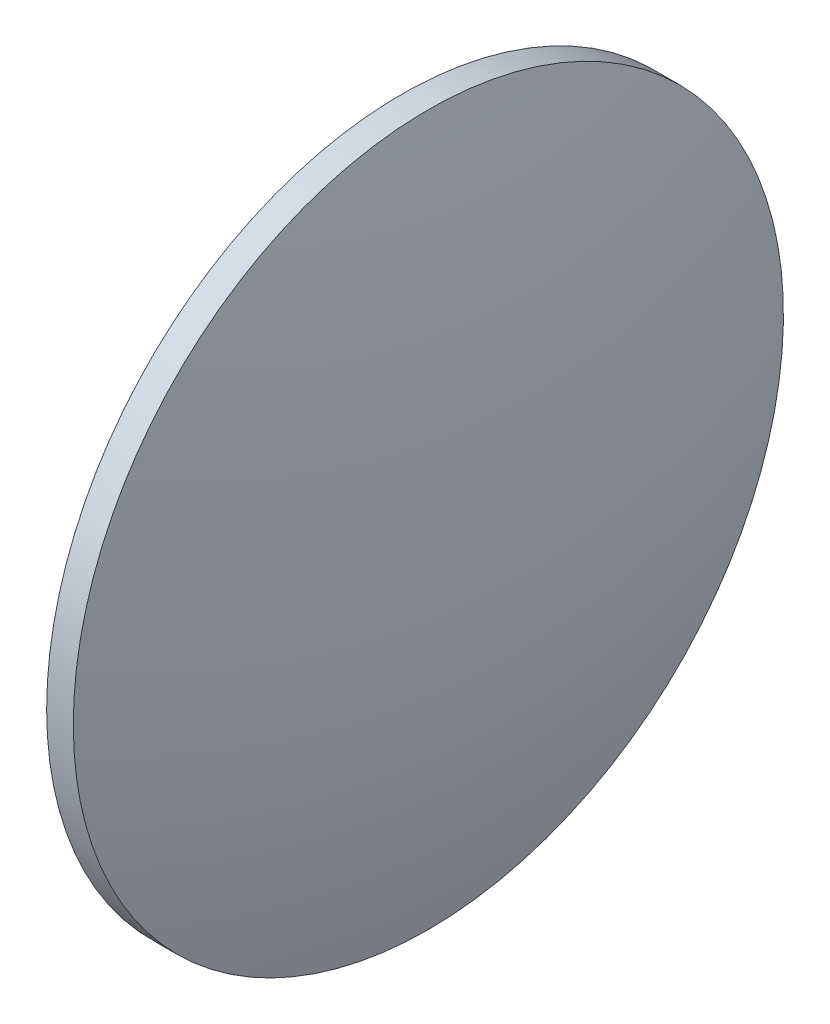
ISO-10303-21;
HEADER;
FILE_DESCRIPTION(('STEP AP214'),'2;1');
FILE_NAME('part.step','',(''),(''),'','','');
FILE_SCHEMA(('AUTOMOTIVE_DESIGN { 1 0 10303 214 1 1 1 1 }'));
ENDSEC;
DATA;
#1=APPLICATION_CONTEXT('core data for automotive mechanical design processes');
#2=APPLICATION_PROTOCOL_DEFINITION('international standard','automotive_design',2000,#1);
#3=PRODUCT_CONTEXT('',#1,'mechanical');
#4=PRODUCT('Part','Part','',(#3));
#5=PRODUCT_RELATED_PRODUCT_CATEGORY('part','',(#4));
#6=PRODUCT_DEFINITION_FORMATION('','',#4);
#7=PRODUCT_DEFINITION_CONTEXT('part definition',#1,'design');
#8=PRODUCT_DEFINITION('design','',#6,#7);
#9=PRODUCT_DEFINITION_SHAPE('','',#8);
#10=(LENGTH_UNIT() NAMED_UNIT(*) SI_UNIT(.MILLI.,.METRE.));
#11=(NAMED_UNIT(*) PLANE_ANGLE_UNIT() SI_UNIT($,.RADIAN.));
#12=(NAMED_UNIT(*) SI_UNIT($,.STERADIAN.) SOLID_ANGLE_UNIT());
#13=UNCERTAINTY_MEASURE_WITH_UNIT(LENGTH_MEASURE(1.E-05),#10,'distance_accuracy_value','');
#14=(GEOMETRIC_REPRESENTATION_CONTEXT(3) GLOBAL_UNCERTAINTY_ASSIGNED_CONTEXT((#13)) GLOBAL_UNIT_ASSIGNED_CONTEXT((#10,
#11,#12)) REPRESENTATION_CONTEXT('',''));
#15=CARTESIAN_POINT('',(0.,0.,0.));
#16=DIRECTION('',(0.,0.,1.));
#17=DIRECTION('',(1.,0.,0.));
#18=AXIS2_PLACEMENT_3D('',#15,#16,#17);
#19=CARTESIAN_POINT('',(79.1931418430682,130.467109852824,0.));
#20=DIRECTION('',(-1.,0.,0.));
#21=DIRECTION('',(0.,-1.,0.));
#22=AXIS2_PLACEMENT_3D('',#19,#20,#21);
#23=SPHERICAL_SURFACE('',#22,155.005952380953);
#24=CARTESIAN_POINT('',(228.949094224021,130.467109852824,0.));
#25=DIRECTION('',(-1.,0.,0.));
#26=DIRECTION('',(0.,0.,1.));
#27=AXIS2_PLACEMENT_3D('',#24,#25,#26);
#28=CIRCLE('',#27,40.);
#29=CARTESIAN_POINT('',(228.949094224021,130.467109852824,40.));
#30=VERTEX_POINT('',#29);
#31=EDGE_CURVE('E10',#30,#30,#28,.T.);
#32=ORIENTED_EDGE('',*,*,#31,.F.);
#33=EDGE_LOOP('',(#32));
#34=FACE_BOUND('',#33,.T.);
#35=ADVANCED_FACE('F35',(#34),#23,.T.);
#36=CARTESIAN_POINT('',(217.994582532387,130.467109852824,0.));
#37=DIRECTION('',(-1.,0.,0.));
#38=DIRECTION('',(0.,0.,1.));
#39=AXIS2_PLACEMENT_3D('',#36,#37,#38);
#40=CYLINDRICAL_SURFACE('',#39,40.);
#41=CARTESIAN_POINT('',(225.949094224021,130.467109852824,0.));
#42=DIRECTION('',(-1.,0.,0.));
#43=DIRECTION('',(0.,0.,1.));
#44=AXIS2_PLACEMENT_3D('',#41,#42,#43);
#45=CIRCLE('',#44,40.);
#46=CARTESIAN_POINT('',(225.949094224021,130.467109852824,40.));
#47=VERTEX_POINT('',#46);
#48=EDGE_CURVE('E41',#47,#47,#45,.T.);
#49=ORIENTED_EDGE('',*,*,#48,.F.);
#50=EDGE_LOOP('',(#49));
#51=FACE_BOUND('',#50,.T.);
#52=ORIENTED_EDGE('',*,*,#31,.T.);
#53=EDGE_LOOP('',(#52));
#54=FACE_BOUND('',#53,.T.);
#55=ADVANCED_FACE('F49',(#51,#54),#40,.T.);
#56=CARTESIAN_POINT('',(225.949094224021,130.467109852824,0.));
#57=DIRECTION('',(1.,0.,0.));
#58=DIRECTION('',(0.,0.,-1.));
#59=AXIS2_PLACEMENT_3D('',#56,#57,#58);
#60=PLANE('',#59);
#61=ORIENTED_EDGE('',*,*,#48,.T.);
#62=EDGE_LOOP('',(#61));
#63=FACE_BOUND('',#62,.T.);
#64=ADVANCED_FACE('F47',(#63),#60,.F.);
#65=CLOSED_SHELL('',(#35,#55,#64));
#66=MANIFOLD_SOLID_BREP('B2',#65);
#67=ADVANCED_BREP_SHAPE_REPRESENTATION('',(#18,#66),#14);
#68=SHAPE_DEFINITION_REPRESENTATION(#9,#67);
ENDSEC;
END-ISO-10303-21;
